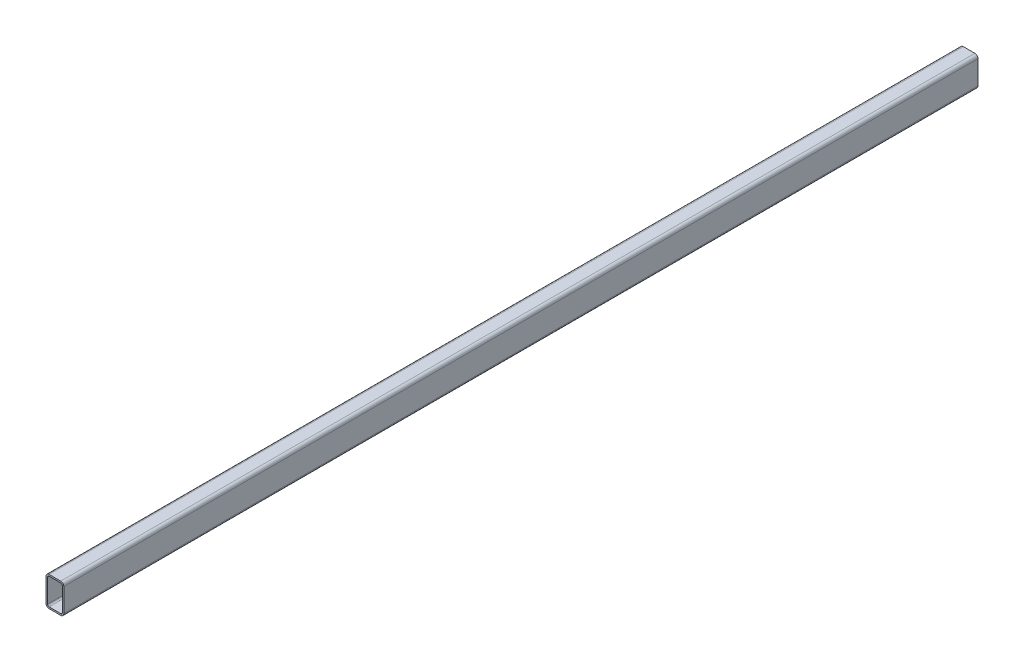
ISO-10303-21;
HEADER;
FILE_DESCRIPTION(('STEP AP214'),'2;1');
FILE_NAME('part.step','',(''),(''),'','','');
FILE_SCHEMA(('AUTOMOTIVE_DESIGN { 1 0 10303 214 1 1 1 1 }'));
ENDSEC;
DATA;
#1=APPLICATION_CONTEXT('core data for automotive mechanical design processes');
#2=APPLICATION_PROTOCOL_DEFINITION('international standard','automotive_design',2000,#1);
#3=PRODUCT_CONTEXT('',#1,'mechanical');
#4=PRODUCT('Part','Part','',(#3));
#5=PRODUCT_RELATED_PRODUCT_CATEGORY('part','',(#4));
#6=PRODUCT_DEFINITION_FORMATION('','',#4);
#7=PRODUCT_DEFINITION_CONTEXT('part definition',#1,'design');
#8=PRODUCT_DEFINITION('design','',#6,#7);
#9=PRODUCT_DEFINITION_SHAPE('','',#8);
#10=(LENGTH_UNIT() NAMED_UNIT(*) SI_UNIT(.MILLI.,.METRE.));
#11=(NAMED_UNIT(*) PLANE_ANGLE_UNIT() SI_UNIT($,.RADIAN.));
#12=(NAMED_UNIT(*) SI_UNIT($,.STERADIAN.) SOLID_ANGLE_UNIT());
#13=UNCERTAINTY_MEASURE_WITH_UNIT(LENGTH_MEASURE(1.E-05),#10,'distance_accuracy_value','');
#14=(GEOMETRIC_REPRESENTATION_CONTEXT(3) GLOBAL_UNCERTAINTY_ASSIGNED_CONTEXT((#13)) GLOBAL_UNIT_ASSIGNED_CONTEXT((#10,
#11,#12)) REPRESENTATION_CONTEXT('',''));
#15=CARTESIAN_POINT('',(0.,0.,0.));
#16=DIRECTION('',(0.,0.,1.));
#17=DIRECTION('',(1.,0.,0.));
#18=AXIS2_PLACEMENT_3D('',#15,#16,#17);
#19=CARTESIAN_POINT('',(24.8,44.8,770.));
#20=DIRECTION('',(0.,0.,1.));
#21=DIRECTION('',(1.,0.,0.));
#22=AXIS2_PLACEMENT_3D('',#19,#20,#21);
#23=PLANE('',#22);
#24=CARTESIAN_POINT('',(24.8,44.8,770.));
#25=DIRECTION('',(0.,0.,1.));
#26=DIRECTION('',(1.,0.,0.));
#27=AXIS2_PLACEMENT_3D('',#24,#25,#26);
#28=CIRCLE('',#27,5.2);
#29=CARTESIAN_POINT('',(30.,44.8,770.));
#30=VERTEX_POINT('',#29);
#31=CARTESIAN_POINT('',(24.8,50.,770.));
#32=VERTEX_POINT('',#31);
#33=EDGE_CURVE('E212',#30,#32,#28,.T.);
#34=ORIENTED_EDGE('',*,*,#33,.T.);
#35=DIRECTION('',(-1.,0.,0.));
#36=VECTOR('',#35,1.);
#37=CARTESIAN_POINT('',(24.8,50.,770.));
#38=LINE('',#37,#36);
#39=CARTESIAN_POINT('',(5.2,50.,770.));
#40=VERTEX_POINT('',#39);
#41=EDGE_CURVE('E215',#32,#40,#38,.T.);
#42=ORIENTED_EDGE('',*,*,#41,.T.);
#43=CARTESIAN_POINT('',(5.2,44.8,770.));
#44=DIRECTION('',(0.,0.,1.));
#45=DIRECTION('',(1.,0.,0.));
#46=AXIS2_PLACEMENT_3D('',#43,#44,#45);
#47=CIRCLE('',#46,5.2);
#48=CARTESIAN_POINT('',(0.,44.8,770.));
#49=VERTEX_POINT('',#48);
#50=EDGE_CURVE('E218',#40,#49,#47,.T.);
#51=ORIENTED_EDGE('',*,*,#50,.T.);
#52=DIRECTION('',(0.,-1.,0.));
#53=VECTOR('',#52,1.);
#54=CARTESIAN_POINT('',(0.,5.2,770.));
#55=LINE('',#54,#53);
#56=CARTESIAN_POINT('',(0.,5.2,770.));
#57=VERTEX_POINT('',#56);
#58=EDGE_CURVE('E220',#49,#57,#55,.T.);
#59=ORIENTED_EDGE('',*,*,#58,.T.);
#60=CARTESIAN_POINT('',(5.2,5.2,770.));
#61=DIRECTION('',(0.,0.,1.));
#62=DIRECTION('',(1.,0.,0.));
#63=AXIS2_PLACEMENT_3D('',#60,#61,#62);
#64=CIRCLE('',#63,5.2);
#65=CARTESIAN_POINT('',(5.2,0.,770.));
#66=VERTEX_POINT('',#65);
#67=EDGE_CURVE('E222',#57,#66,#64,.T.);
#68=ORIENTED_EDGE('',*,*,#67,.T.);
#69=DIRECTION('',(1.,0.,0.));
#70=VECTOR('',#69,1.);
#71=CARTESIAN_POINT('',(5.2,0.,770.));
#72=LINE('',#71,#70);
#73=CARTESIAN_POINT('',(24.8,0.,770.));
#74=VERTEX_POINT('',#73);
#75=EDGE_CURVE('E224',#66,#74,#72,.T.);
#76=ORIENTED_EDGE('',*,*,#75,.T.);
#77=CARTESIAN_POINT('',(24.8,5.2,770.));
#78=DIRECTION('',(0.,0.,1.));
#79=DIRECTION('',(1.,0.,0.));
#80=AXIS2_PLACEMENT_3D('',#77,#78,#79);
#81=CIRCLE('',#80,5.2);
#82=CARTESIAN_POINT('',(30.,5.2,770.));
#83=VERTEX_POINT('',#82);
#84=EDGE_CURVE('E226',#74,#83,#81,.T.);
#85=ORIENTED_EDGE('',*,*,#84,.T.);
#86=DIRECTION('',(0.,1.,0.));
#87=VECTOR('',#86,1.);
#88=CARTESIAN_POINT('',(30.,44.8,770.));
#89=LINE('',#88,#87);
#90=EDGE_CURVE('E228',#83,#30,#89,.T.);
#91=ORIENTED_EDGE('',*,*,#90,.T.);
#92=EDGE_LOOP('',(#34,#42,#51,#59,#68,#76,#85,#91));
#93=FACE_BOUND('',#92,.T.);
#94=DIRECTION('',(0.,-1.,0.));
#95=VECTOR('',#94,1.);
#96=CARTESIAN_POINT('',(2.6,5.2,770.));
#97=LINE('',#96,#95);
#98=CARTESIAN_POINT('',(2.6,44.8,770.));
#99=VERTEX_POINT('',#98);
#100=CARTESIAN_POINT('',(2.6,5.2,770.));
#101=VERTEX_POINT('',#100);
#102=EDGE_CURVE('E155',#99,#101,#97,.T.);
#103=ORIENTED_EDGE('',*,*,#102,.F.);
#104=CARTESIAN_POINT('',(5.2,44.8,770.));
#105=DIRECTION('',(0.,0.,1.));
#106=DIRECTION('',(1.,0.,0.));
#107=AXIS2_PLACEMENT_3D('',#104,#105,#106);
#108=CIRCLE('',#107,2.60000000000001);
#109=CARTESIAN_POINT('',(5.2,47.4,770.));
#110=VERTEX_POINT('',#109);
#111=EDGE_CURVE('E147',#110,#99,#108,.T.);
#112=ORIENTED_EDGE('',*,*,#111,.F.);
#113=DIRECTION('',(-1.,0.,0.));
#114=VECTOR('',#113,1.);
#115=CARTESIAN_POINT('',(24.8,47.4,770.));
#116=LINE('',#115,#114);
#117=CARTESIAN_POINT('',(24.8,47.4,770.));
#118=VERTEX_POINT('',#117);
#119=EDGE_CURVE('E180',#118,#110,#116,.T.);
#120=ORIENTED_EDGE('',*,*,#119,.F.);
#121=CARTESIAN_POINT('',(24.8,44.8,770.));
#122=DIRECTION('',(0.,0.,1.));
#123=DIRECTION('',(1.,0.,0.));
#124=AXIS2_PLACEMENT_3D('',#121,#122,#123);
#125=CIRCLE('',#124,2.6);
#126=CARTESIAN_POINT('',(27.4,44.8,770.));
#127=VERTEX_POINT('',#126);
#128=EDGE_CURVE('E178',#127,#118,#125,.T.);
#129=ORIENTED_EDGE('',*,*,#128,.F.);
#130=DIRECTION('',(0.,1.,0.));
#131=VECTOR('',#130,1.);
#132=CARTESIAN_POINT('',(27.4,44.8,770.));
#133=LINE('',#132,#131);
#134=CARTESIAN_POINT('',(27.4,5.2,770.));
#135=VERTEX_POINT('',#134);
#136=EDGE_CURVE('E176',#135,#127,#133,.T.);
#137=ORIENTED_EDGE('',*,*,#136,.F.);
#138=CARTESIAN_POINT('',(24.8,5.2,770.));
#139=DIRECTION('',(0.,0.,1.));
#140=DIRECTION('',(1.,0.,0.));
#141=AXIS2_PLACEMENT_3D('',#138,#139,#140);
#142=CIRCLE('',#141,2.6);
#143=CARTESIAN_POINT('',(24.8,2.6,770.));
#144=VERTEX_POINT('',#143);
#145=EDGE_CURVE('E174',#144,#135,#142,.T.);
#146=ORIENTED_EDGE('',*,*,#145,.F.);
#147=DIRECTION('',(1.,0.,0.));
#148=VECTOR('',#147,1.);
#149=CARTESIAN_POINT('',(5.2,2.6,770.));
#150=LINE('',#149,#148);
#151=CARTESIAN_POINT('',(5.2,2.6,770.));
#152=VERTEX_POINT('',#151);
#153=EDGE_CURVE('E170',#152,#144,#150,.T.);
#154=ORIENTED_EDGE('',*,*,#153,.F.);
#155=CARTESIAN_POINT('',(5.2,5.2,770.));
#156=DIRECTION('',(0.,0.,1.));
#157=DIRECTION('',(1.,0.,0.));
#158=AXIS2_PLACEMENT_3D('',#155,#156,#157);
#159=CIRCLE('',#158,2.6);
#160=EDGE_CURVE('E168',#101,#152,#159,.T.);
#161=ORIENTED_EDGE('',*,*,#160,.F.);
#162=EDGE_LOOP('',(#103,#112,#120,#129,#137,#146,#154,#161));
#163=FACE_BOUND('',#162,.T.);
#164=ADVANCED_FACE('F34',(#93,#163),#23,.T.);
#165=CARTESIAN_POINT('',(24.8,44.8,-770.));
#166=DIRECTION('',(0.,0.,1.));
#167=DIRECTION('',(1.,0.,0.));
#168=AXIS2_PLACEMENT_3D('',#165,#166,#167);
#169=PLANE('',#168);
#170=CARTESIAN_POINT('',(24.8,44.8,-770.));
#171=DIRECTION('',(0.,0.,1.));
#172=DIRECTION('',(1.,0.,0.));
#173=AXIS2_PLACEMENT_3D('',#170,#171,#172);
#174=CIRCLE('',#173,5.2);
#175=CARTESIAN_POINT('',(30.,44.8,-770.));
#176=VERTEX_POINT('',#175);
#177=CARTESIAN_POINT('',(24.8,50.,-770.));
#178=VERTEX_POINT('',#177);
#179=EDGE_CURVE('E163',#176,#178,#174,.T.);
#180=ORIENTED_EDGE('',*,*,#179,.F.);
#181=DIRECTION('',(0.,1.,0.));
#182=VECTOR('',#181,1.);
#183=CARTESIAN_POINT('',(30.,44.8,-770.));
#184=LINE('',#183,#182);
#185=CARTESIAN_POINT('',(30.,5.2,-770.));
#186=VERTEX_POINT('',#185);
#187=EDGE_CURVE('E216',#186,#176,#184,.T.);
#188=ORIENTED_EDGE('',*,*,#187,.F.);
#189=CARTESIAN_POINT('',(24.8,5.2,-770.));
#190=DIRECTION('',(0.,0.,1.));
#191=DIRECTION('',(1.,0.,0.));
#192=AXIS2_PLACEMENT_3D('',#189,#190,#191);
#193=CIRCLE('',#192,5.2);
#194=CARTESIAN_POINT('',(24.8,0.,-770.));
#195=VERTEX_POINT('',#194);
#196=EDGE_CURVE('E243',#195,#186,#193,.T.);
#197=ORIENTED_EDGE('',*,*,#196,.F.);
#198=DIRECTION('',(1.,0.,0.));
#199=VECTOR('',#198,1.);
#200=CARTESIAN_POINT('',(5.2,0.,-770.));
#201=LINE('',#200,#199);
#202=CARTESIAN_POINT('',(5.2,0.,-770.));
#203=VERTEX_POINT('',#202);
#204=EDGE_CURVE('E241',#203,#195,#201,.T.);
#205=ORIENTED_EDGE('',*,*,#204,.F.);
#206=CARTESIAN_POINT('',(5.2,5.2,-770.));
#207=DIRECTION('',(0.,0.,1.));
#208=DIRECTION('',(1.,0.,0.));
#209=AXIS2_PLACEMENT_3D('',#206,#207,#208);
#210=CIRCLE('',#209,5.2);
#211=CARTESIAN_POINT('',(0.,5.2,-770.));
#212=VERTEX_POINT('',#211);
#213=EDGE_CURVE('E239',#212,#203,#210,.T.);
#214=ORIENTED_EDGE('',*,*,#213,.F.);
#215=DIRECTION('',(0.,-1.,0.));
#216=VECTOR('',#215,1.);
#217=CARTESIAN_POINT('',(0.,5.2,-770.));
#218=LINE('',#217,#216);
#219=CARTESIAN_POINT('',(0.,44.8,-770.));
#220=VERTEX_POINT('',#219);
#221=EDGE_CURVE('E237',#220,#212,#218,.T.);
#222=ORIENTED_EDGE('',*,*,#221,.F.);
#223=CARTESIAN_POINT('',(5.2,44.8,-770.));
#224=DIRECTION('',(0.,0.,1.));
#225=DIRECTION('',(1.,0.,0.));
#226=AXIS2_PLACEMENT_3D('',#223,#224,#225);
#227=CIRCLE('',#226,5.2);
#228=CARTESIAN_POINT('',(5.2,50.,-770.));
#229=VERTEX_POINT('',#228);
#230=EDGE_CURVE('E235',#229,#220,#227,.T.);
#231=ORIENTED_EDGE('',*,*,#230,.F.);
#232=DIRECTION('',(-1.,0.,0.));
#233=VECTOR('',#232,1.);
#234=CARTESIAN_POINT('',(24.8,50.,-770.));
#235=LINE('',#234,#233);
#236=EDGE_CURVE('E233',#178,#229,#235,.T.);
#237=ORIENTED_EDGE('',*,*,#236,.F.);
#238=EDGE_LOOP('',(#180,#188,#197,#205,#214,#222,#231,#237));
#239=FACE_BOUND('',#238,.T.);
#240=CARTESIAN_POINT('',(5.2,44.8,-770.));
#241=DIRECTION('',(0.,0.,1.));
#242=DIRECTION('',(1.,0.,0.));
#243=AXIS2_PLACEMENT_3D('',#240,#241,#242);
#244=CIRCLE('',#243,2.60000000000001);
#245=CARTESIAN_POINT('',(5.2,47.4,-770.));
#246=VERTEX_POINT('',#245);
#247=CARTESIAN_POINT('',(2.6,44.8,-770.));
#248=VERTEX_POINT('',#247);
#249=EDGE_CURVE('E57',#246,#248,#244,.T.);
#250=ORIENTED_EDGE('',*,*,#249,.T.);
#251=DIRECTION('',(0.,-1.,0.));
#252=VECTOR('',#251,1.);
#253=CARTESIAN_POINT('',(2.6,5.2,-770.));
#254=LINE('',#253,#252);
#255=CARTESIAN_POINT('',(2.6,5.2,-770.));
#256=VERTEX_POINT('',#255);
#257=EDGE_CURVE('E162',#248,#256,#254,.T.);
#258=ORIENTED_EDGE('',*,*,#257,.T.);
#259=CARTESIAN_POINT('',(5.2,5.2,-770.));
#260=DIRECTION('',(0.,0.,1.));
#261=DIRECTION('',(1.,0.,0.));
#262=AXIS2_PLACEMENT_3D('',#259,#260,#261);
#263=CIRCLE('',#262,2.6);
#264=CARTESIAN_POINT('',(5.2,2.6,-770.));
#265=VERTEX_POINT('',#264);
#266=EDGE_CURVE('E184',#256,#265,#263,.T.);
#267=ORIENTED_EDGE('',*,*,#266,.T.);
#268=DIRECTION('',(1.,0.,0.));
#269=VECTOR('',#268,1.);
#270=CARTESIAN_POINT('',(5.2,2.6,-770.));
#271=LINE('',#270,#269);
#272=CARTESIAN_POINT('',(24.8,2.6,-770.));
#273=VERTEX_POINT('',#272);
#274=EDGE_CURVE('E187',#265,#273,#271,.T.);
#275=ORIENTED_EDGE('',*,*,#274,.T.);
#276=CARTESIAN_POINT('',(24.8,5.2,-770.));
#277=DIRECTION('',(0.,0.,1.));
#278=DIRECTION('',(1.,0.,0.));
#279=AXIS2_PLACEMENT_3D('',#276,#277,#278);
#280=CIRCLE('',#279,2.6);
#281=CARTESIAN_POINT('',(27.4,5.2,-770.));
#282=VERTEX_POINT('',#281);
#283=EDGE_CURVE('E190',#273,#282,#280,.T.);
#284=ORIENTED_EDGE('',*,*,#283,.T.);
#285=DIRECTION('',(0.,1.,0.));
#286=VECTOR('',#285,1.);
#287=CARTESIAN_POINT('',(27.4,44.8,-770.));
#288=LINE('',#287,#286);
#289=CARTESIAN_POINT('',(27.4,44.8,-770.));
#290=VERTEX_POINT('',#289);
#291=EDGE_CURVE('E193',#282,#290,#288,.T.);
#292=ORIENTED_EDGE('',*,*,#291,.T.);
#293=CARTESIAN_POINT('',(24.8,44.8,-770.));
#294=DIRECTION('',(0.,0.,1.));
#295=DIRECTION('',(1.,0.,0.));
#296=AXIS2_PLACEMENT_3D('',#293,#294,#295);
#297=CIRCLE('',#296,2.6);
#298=CARTESIAN_POINT('',(24.8,47.4,-770.));
#299=VERTEX_POINT('',#298);
#300=EDGE_CURVE('E196',#290,#299,#297,.T.);
#301=ORIENTED_EDGE('',*,*,#300,.T.);
#302=DIRECTION('',(-1.,0.,0.));
#303=VECTOR('',#302,1.);
#304=CARTESIAN_POINT('',(24.8,47.4,-770.));
#305=LINE('',#304,#303);
#306=EDGE_CURVE('E156',#299,#246,#305,.T.);
#307=ORIENTED_EDGE('',*,*,#306,.T.);
#308=EDGE_LOOP('',(#250,#258,#267,#275,#284,#292,#301,#307));
#309=FACE_BOUND('',#308,.T.);
#310=ADVANCED_FACE('F273',(#239,#309),#169,.F.);
#311=CARTESIAN_POINT('',(24.8,44.8,770.));
#312=DIRECTION('',(0.,0.,-1.));
#313=DIRECTION('',(-1.,0.,0.));
#314=AXIS2_PLACEMENT_3D('',#311,#312,#313);
#315=CYLINDRICAL_SURFACE('',#314,5.2);
#316=ORIENTED_EDGE('',*,*,#179,.T.);
#317=DIRECTION('',(0.,0.,-1.));
#318=VECTOR('',#317,1.);
#319=CARTESIAN_POINT('',(24.8,50.,770.));
#320=LINE('',#319,#318);
#321=EDGE_CURVE('E11',#32,#178,#320,.T.);
#322=ORIENTED_EDGE('',*,*,#321,.F.);
#323=ORIENTED_EDGE('',*,*,#33,.F.);
#324=DIRECTION('',(0.,0.,-1.));
#325=VECTOR('',#324,1.);
#326=CARTESIAN_POINT('',(30.,44.8,770.));
#327=LINE('',#326,#325);
#328=EDGE_CURVE('E230',#30,#176,#327,.T.);
#329=ORIENTED_EDGE('',*,*,#328,.T.);
#330=EDGE_LOOP('',(#316,#322,#323,#329));
#331=FACE_BOUND('',#330,.T.);
#332=ADVANCED_FACE('F36',(#331),#315,.T.);
#333=CARTESIAN_POINT('',(24.8,50.,770.));
#334=DIRECTION('',(0.,-1.,0.));
#335=DIRECTION('',(0.,0.,-1.));
#336=AXIS2_PLACEMENT_3D('',#333,#334,#335);
#337=PLANE('',#336);
#338=ORIENTED_EDGE('',*,*,#236,.T.);
#339=DIRECTION('',(0.,0.,-1.));
#340=VECTOR('',#339,1.);
#341=CARTESIAN_POINT('',(5.2,50.,770.));
#342=LINE('',#341,#340);
#343=EDGE_CURVE('E42',#40,#229,#342,.T.);
#344=ORIENTED_EDGE('',*,*,#343,.F.);
#345=ORIENTED_EDGE('',*,*,#41,.F.);
#346=ORIENTED_EDGE('',*,*,#321,.T.);
#347=EDGE_LOOP('',(#338,#344,#345,#346));
#348=FACE_BOUND('',#347,.T.);
#349=ADVANCED_FACE('F290',(#348),#337,.F.);
#350=CARTESIAN_POINT('',(5.2,44.8,770.));
#351=DIRECTION('',(0.,0.,-1.));
#352=DIRECTION('',(-1.,0.,0.));
#353=AXIS2_PLACEMENT_3D('',#350,#351,#352);
#354=CYLINDRICAL_SURFACE('',#353,5.2);
#355=ORIENTED_EDGE('',*,*,#230,.T.);
#356=DIRECTION('',(0.,0.,-1.));
#357=VECTOR('',#356,1.);
#358=CARTESIAN_POINT('',(0.,44.8,770.));
#359=LINE('',#358,#357);
#360=EDGE_CURVE('E260',#49,#220,#359,.T.);
#361=ORIENTED_EDGE('',*,*,#360,.F.);
#362=ORIENTED_EDGE('',*,*,#50,.F.);
#363=ORIENTED_EDGE('',*,*,#343,.T.);
#364=EDGE_LOOP('',(#355,#361,#362,#363));
#365=FACE_BOUND('',#364,.T.);
#366=ADVANCED_FACE('F267',(#365),#354,.T.);
#367=CARTESIAN_POINT('',(0.,5.2,770.));
#368=DIRECTION('',(1.,0.,0.));
#369=DIRECTION('',(0.,1.,0.));
#370=AXIS2_PLACEMENT_3D('',#367,#368,#369);
#371=PLANE('',#370);
#372=ORIENTED_EDGE('',*,*,#221,.T.);
#373=DIRECTION('',(0.,0.,-1.));
#374=VECTOR('',#373,1.);
#375=CARTESIAN_POINT('',(0.,5.2,770.));
#376=LINE('',#375,#374);
#377=EDGE_CURVE('E257',#57,#212,#376,.T.);
#378=ORIENTED_EDGE('',*,*,#377,.F.);
#379=ORIENTED_EDGE('',*,*,#58,.F.);
#380=ORIENTED_EDGE('',*,*,#360,.T.);
#381=EDGE_LOOP('',(#372,#378,#379,#380));
#382=FACE_BOUND('',#381,.T.);
#383=ADVANCED_FACE('F279',(#382),#371,.F.);
#384=CARTESIAN_POINT('',(5.2,5.2,770.));
#385=DIRECTION('',(0.,0.,-1.));
#386=DIRECTION('',(-1.,0.,0.));
#387=AXIS2_PLACEMENT_3D('',#384,#385,#386);
#388=CYLINDRICAL_SURFACE('',#387,5.2);
#389=ORIENTED_EDGE('',*,*,#213,.T.);
#390=DIRECTION('',(0.,0.,-1.));
#391=VECTOR('',#390,1.);
#392=CARTESIAN_POINT('',(5.2,0.,770.));
#393=LINE('',#392,#391);
#394=EDGE_CURVE('E254',#66,#203,#393,.T.);
#395=ORIENTED_EDGE('',*,*,#394,.F.);
#396=ORIENTED_EDGE('',*,*,#67,.F.);
#397=ORIENTED_EDGE('',*,*,#377,.T.);
#398=EDGE_LOOP('',(#389,#395,#396,#397));
#399=FACE_BOUND('',#398,.T.);
#400=ADVANCED_FACE('F283',(#399),#388,.T.);
#401=CARTESIAN_POINT('',(5.2,0.,770.));
#402=DIRECTION('',(0.,1.,0.));
#403=DIRECTION('',(-1.,0.,0.));
#404=AXIS2_PLACEMENT_3D('',#401,#402,#403);
#405=PLANE('',#404);
#406=ORIENTED_EDGE('',*,*,#204,.T.);
#407=DIRECTION('',(0.,0.,-1.));
#408=VECTOR('',#407,1.);
#409=CARTESIAN_POINT('',(24.8,0.,770.));
#410=LINE('',#409,#408);
#411=EDGE_CURVE('E251',#74,#195,#410,.T.);
#412=ORIENTED_EDGE('',*,*,#411,.F.);
#413=ORIENTED_EDGE('',*,*,#75,.F.);
#414=ORIENTED_EDGE('',*,*,#394,.T.);
#415=EDGE_LOOP('',(#406,#412,#413,#414));
#416=FACE_BOUND('',#415,.T.);
#417=ADVANCED_FACE('F303',(#416),#405,.F.);
#418=CARTESIAN_POINT('',(24.8,5.2,770.));
#419=DIRECTION('',(0.,0.,-1.));
#420=DIRECTION('',(-1.,0.,0.));
#421=AXIS2_PLACEMENT_3D('',#418,#419,#420);
#422=CYLINDRICAL_SURFACE('',#421,5.2);
#423=ORIENTED_EDGE('',*,*,#196,.T.);
#424=DIRECTION('',(0.,0.,-1.));
#425=VECTOR('',#424,1.);
#426=CARTESIAN_POINT('',(30.,5.2,770.));
#427=LINE('',#426,#425);
#428=EDGE_CURVE('E248',#83,#186,#427,.T.);
#429=ORIENTED_EDGE('',*,*,#428,.F.);
#430=ORIENTED_EDGE('',*,*,#84,.F.);
#431=ORIENTED_EDGE('',*,*,#411,.T.);
#432=EDGE_LOOP('',(#423,#429,#430,#431));
#433=FACE_BOUND('',#432,.T.);
#434=ADVANCED_FACE('F301',(#433),#422,.T.);
#435=CARTESIAN_POINT('',(30.,44.8,770.));
#436=DIRECTION('',(-1.,0.,0.));
#437=DIRECTION('',(0.,-1.,0.));
#438=AXIS2_PLACEMENT_3D('',#435,#436,#437);
#439=PLANE('',#438);
#440=ORIENTED_EDGE('',*,*,#187,.T.);
#441=ORIENTED_EDGE('',*,*,#328,.F.);
#442=ORIENTED_EDGE('',*,*,#90,.F.);
#443=ORIENTED_EDGE('',*,*,#428,.T.);
#444=EDGE_LOOP('',(#440,#441,#442,#443));
#445=FACE_BOUND('',#444,.T.);
#446=ADVANCED_FACE('F296',(#445),#439,.F.);
#447=CARTESIAN_POINT('',(5.2,44.8,770.));
#448=DIRECTION('',(0.,0.,-1.));
#449=DIRECTION('',(-1.,0.,0.));
#450=AXIS2_PLACEMENT_3D('',#447,#448,#449);
#451=CYLINDRICAL_SURFACE('',#450,2.60000000000001);
#452=ORIENTED_EDGE('',*,*,#249,.F.);
#453=DIRECTION('',(0.,0.,-1.));
#454=VECTOR('',#453,1.);
#455=CARTESIAN_POINT('',(5.2,47.4,770.));
#456=LINE('',#455,#454);
#457=EDGE_CURVE('E151',#110,#246,#456,.T.);
#458=ORIENTED_EDGE('',*,*,#457,.F.);
#459=ORIENTED_EDGE('',*,*,#111,.T.);
#460=DIRECTION('',(0.,0.,-1.));
#461=VECTOR('',#460,1.);
#462=CARTESIAN_POINT('',(2.6,44.8,770.));
#463=LINE('',#462,#461);
#464=EDGE_CURVE('E150',#99,#248,#463,.T.);
#465=ORIENTED_EDGE('',*,*,#464,.T.);
#466=EDGE_LOOP('',(#452,#458,#459,#465));
#467=FACE_BOUND('',#466,.T.);
#468=ADVANCED_FACE('F149',(#467),#451,.F.);
#469=CARTESIAN_POINT('',(2.6,5.2,770.));
#470=DIRECTION('',(1.,0.,0.));
#471=DIRECTION('',(0.,1.,0.));
#472=AXIS2_PLACEMENT_3D('',#469,#470,#471);
#473=PLANE('',#472);
#474=ORIENTED_EDGE('',*,*,#257,.F.);
#475=ORIENTED_EDGE('',*,*,#464,.F.);
#476=ORIENTED_EDGE('',*,*,#102,.T.);
#477=DIRECTION('',(0.,0.,-1.));
#478=VECTOR('',#477,1.);
#479=CARTESIAN_POINT('',(2.6,5.2,770.));
#480=LINE('',#479,#478);
#481=EDGE_CURVE('E164',#101,#256,#480,.T.);
#482=ORIENTED_EDGE('',*,*,#481,.T.);
#483=EDGE_LOOP('',(#474,#475,#476,#482));
#484=FACE_BOUND('',#483,.T.);
#485=ADVANCED_FACE('F159',(#484),#473,.T.);
#486=CARTESIAN_POINT('',(5.2,5.2,770.));
#487=DIRECTION('',(0.,0.,-1.));
#488=DIRECTION('',(-1.,0.,0.));
#489=AXIS2_PLACEMENT_3D('',#486,#487,#488);
#490=CYLINDRICAL_SURFACE('',#489,2.6);
#491=ORIENTED_EDGE('',*,*,#266,.F.);
#492=ORIENTED_EDGE('',*,*,#481,.F.);
#493=ORIENTED_EDGE('',*,*,#160,.T.);
#494=DIRECTION('',(0.,0.,-1.));
#495=VECTOR('',#494,1.);
#496=CARTESIAN_POINT('',(5.2,2.6,770.));
#497=LINE('',#496,#495);
#498=EDGE_CURVE('E209',#152,#265,#497,.T.);
#499=ORIENTED_EDGE('',*,*,#498,.T.);
#500=EDGE_LOOP('',(#491,#492,#493,#499));
#501=FACE_BOUND('',#500,.T.);
#502=ADVANCED_FACE('F328',(#501),#490,.F.);
#503=CARTESIAN_POINT('',(5.2,2.6,770.));
#504=DIRECTION('',(0.,1.,0.));
#505=DIRECTION('',(-1.,0.,0.));
#506=AXIS2_PLACEMENT_3D('',#503,#504,#505);
#507=PLANE('',#506);
#508=ORIENTED_EDGE('',*,*,#274,.F.);
#509=ORIENTED_EDGE('',*,*,#498,.F.);
#510=ORIENTED_EDGE('',*,*,#153,.T.);
#511=DIRECTION('',(0.,0.,-1.));
#512=VECTOR('',#511,1.);
#513=CARTESIAN_POINT('',(24.8,2.6,770.));
#514=LINE('',#513,#512);
#515=EDGE_CURVE('E207',#144,#273,#514,.T.);
#516=ORIENTED_EDGE('',*,*,#515,.T.);
#517=EDGE_LOOP('',(#508,#509,#510,#516));
#518=FACE_BOUND('',#517,.T.);
#519=ADVANCED_FACE('F332',(#518),#507,.T.);
#520=CARTESIAN_POINT('',(24.8,5.2,770.));
#521=DIRECTION('',(0.,0.,-1.));
#522=DIRECTION('',(-1.,0.,0.));
#523=AXIS2_PLACEMENT_3D('',#520,#521,#522);
#524=CYLINDRICAL_SURFACE('',#523,2.6);
#525=ORIENTED_EDGE('',*,*,#283,.F.);
#526=ORIENTED_EDGE('',*,*,#515,.F.);
#527=ORIENTED_EDGE('',*,*,#145,.T.);
#528=DIRECTION('',(0.,0.,-1.));
#529=VECTOR('',#528,1.);
#530=CARTESIAN_POINT('',(27.4,5.2,770.));
#531=LINE('',#530,#529);
#532=EDGE_CURVE('E205',#135,#282,#531,.T.);
#533=ORIENTED_EDGE('',*,*,#532,.T.);
#534=EDGE_LOOP('',(#525,#526,#527,#533));
#535=FACE_BOUND('',#534,.T.);
#536=ADVANCED_FACE('F338',(#535),#524,.F.);
#537=CARTESIAN_POINT('',(27.4,44.8,770.));
#538=DIRECTION('',(-1.,0.,0.));
#539=DIRECTION('',(0.,0.,1.));
#540=AXIS2_PLACEMENT_3D('',#537,#538,#539);
#541=PLANE('',#540);
#542=ORIENTED_EDGE('',*,*,#291,.F.);
#543=ORIENTED_EDGE('',*,*,#532,.F.);
#544=ORIENTED_EDGE('',*,*,#136,.T.);
#545=DIRECTION('',(0.,0.,-1.));
#546=VECTOR('',#545,1.);
#547=CARTESIAN_POINT('',(27.4,44.8,770.));
#548=LINE('',#547,#546);
#549=EDGE_CURVE('E203',#127,#290,#548,.T.);
#550=ORIENTED_EDGE('',*,*,#549,.T.);
#551=EDGE_LOOP('',(#542,#543,#544,#550));
#552=FACE_BOUND('',#551,.T.);
#553=ADVANCED_FACE('F342',(#552),#541,.T.);
#554=CARTESIAN_POINT('',(24.8,44.8,770.));
#555=DIRECTION('',(0.,0.,-1.));
#556=DIRECTION('',(-1.,0.,0.));
#557=AXIS2_PLACEMENT_3D('',#554,#555,#556);
#558=CYLINDRICAL_SURFACE('',#557,2.6);
#559=ORIENTED_EDGE('',*,*,#300,.F.);
#560=ORIENTED_EDGE('',*,*,#549,.F.);
#561=ORIENTED_EDGE('',*,*,#128,.T.);
#562=DIRECTION('',(0.,0.,-1.));
#563=VECTOR('',#562,1.);
#564=CARTESIAN_POINT('',(24.8,47.4,770.));
#565=LINE('',#564,#563);
#566=EDGE_CURVE('E49',#118,#299,#565,.T.);
#567=ORIENTED_EDGE('',*,*,#566,.T.);
#568=EDGE_LOOP('',(#559,#560,#561,#567));
#569=FACE_BOUND('',#568,.T.);
#570=ADVANCED_FACE('F346',(#569),#558,.F.);
#571=CARTESIAN_POINT('',(24.8,47.4,770.));
#572=DIRECTION('',(0.,-1.,0.));
#573=DIRECTION('',(1.,0.,0.));
#574=AXIS2_PLACEMENT_3D('',#571,#572,#573);
#575=PLANE('',#574);
#576=ORIENTED_EDGE('',*,*,#306,.F.);
#577=ORIENTED_EDGE('',*,*,#566,.F.);
#578=ORIENTED_EDGE('',*,*,#119,.T.);
#579=ORIENTED_EDGE('',*,*,#457,.T.);
#580=EDGE_LOOP('',(#576,#577,#578,#579));
#581=FACE_BOUND('',#580,.T.);
#582=ADVANCED_FACE('F350',(#581),#575,.T.);
#583=CLOSED_SHELL('',(#164,#310,#332,#349,#366,#383,#400,#417,#434,#446,#468,#485,#502,#519,
#536,#553,#570,#582));
#584=MANIFOLD_SOLID_BREP('B2',#583);
#585=ADVANCED_BREP_SHAPE_REPRESENTATION('',(#18,#584),#14);
#586=SHAPE_DEFINITION_REPRESENTATION(#9,#585);
ENDSEC;
END-ISO-10303-21;
